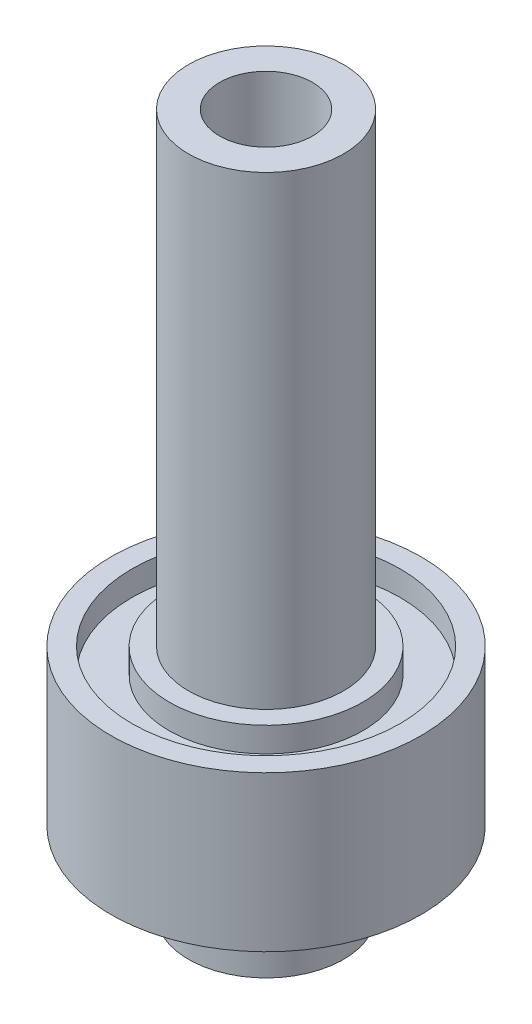
ISO-10303-21;
HEADER;
FILE_DESCRIPTION(('STEP AP214'),'2;1');
FILE_NAME('part.step','',(''),(''),'','','');
FILE_SCHEMA(('AUTOMOTIVE_DESIGN { 1 0 10303 214 1 1 1 1 }'));
ENDSEC;
DATA;
#1=APPLICATION_CONTEXT('core data for automotive mechanical design processes');
#2=APPLICATION_PROTOCOL_DEFINITION('international standard','automotive_design',2000,#1);
#3=PRODUCT_CONTEXT('',#1,'mechanical');
#4=PRODUCT('Part','Part','',(#3));
#5=PRODUCT_RELATED_PRODUCT_CATEGORY('part','',(#4));
#6=PRODUCT_DEFINITION_FORMATION('','',#4);
#7=PRODUCT_DEFINITION_CONTEXT('part definition',#1,'design');
#8=PRODUCT_DEFINITION('design','',#6,#7);
#9=PRODUCT_DEFINITION_SHAPE('','',#8);
#10=(LENGTH_UNIT() NAMED_UNIT(*) SI_UNIT(.MILLI.,.METRE.));
#11=(NAMED_UNIT(*) PLANE_ANGLE_UNIT() SI_UNIT($,.RADIAN.));
#12=(NAMED_UNIT(*) SI_UNIT($,.STERADIAN.) SOLID_ANGLE_UNIT());
#13=UNCERTAINTY_MEASURE_WITH_UNIT(LENGTH_MEASURE(1.E-05),#10,'distance_accuracy_value','');
#14=(GEOMETRIC_REPRESENTATION_CONTEXT(3) GLOBAL_UNCERTAINTY_ASSIGNED_CONTEXT((#13)) GLOBAL_UNIT_ASSIGNED_CONTEXT((#10,
#11,#12)) REPRESENTATION_CONTEXT('',''));
#15=CARTESIAN_POINT('',(0.,0.,0.));
#16=DIRECTION('',(0.,0.,1.));
#17=DIRECTION('',(1.,0.,0.));
#18=AXIS2_PLACEMENT_3D('',#15,#16,#17);
#19=CARTESIAN_POINT('',(0.,0.,0.));
#20=DIRECTION('',(0.,-1.,0.));
#21=DIRECTION('',(0.,0.,-1.));
#22=AXIS2_PLACEMENT_3D('',#19,#20,#21);
#23=CYLINDRICAL_SURFACE('',#22,3.81);
#24=CARTESIAN_POINT('',(0.,57.15,0.));
#25=DIRECTION('',(0.,-1.,0.));
#26=DIRECTION('',(0.,0.,-1.));
#27=AXIS2_PLACEMENT_3D('',#24,#25,#26);
#28=CIRCLE('',#27,3.81000000000001);
#29=CARTESIAN_POINT('',(0.,57.15,-3.81000000000001));
#30=VERTEX_POINT('',#29);
#31=EDGE_CURVE('E88',#30,#30,#28,.T.);
#32=ORIENTED_EDGE('',*,*,#31,.F.);
#33=EDGE_LOOP('',(#32));
#34=FACE_BOUND('',#33,.T.);
#35=CARTESIAN_POINT('',(0.,0.,0.));
#36=DIRECTION('',(0.,-1.,0.));
#37=DIRECTION('',(0.,0.,-1.));
#38=AXIS2_PLACEMENT_3D('',#35,#36,#37);
#39=CIRCLE('',#38,3.81);
#40=CARTESIAN_POINT('',(0.,0.,-3.81));
#41=VERTEX_POINT('',#40);
#42=EDGE_CURVE('E10',#41,#41,#39,.T.);
#43=ORIENTED_EDGE('',*,*,#42,.T.);
#44=EDGE_LOOP('',(#43));
#45=FACE_BOUND('',#44,.T.);
#46=ADVANCED_FACE('F37',(#34,#45),#23,.F.);
#47=CARTESIAN_POINT('',(-3.81,0.,0.));
#48=DIRECTION('',(0.,1.,0.));
#49=DIRECTION('',(0.,0.,1.));
#50=AXIS2_PLACEMENT_3D('',#47,#48,#49);
#51=PLANE('',#50);
#52=ORIENTED_EDGE('',*,*,#42,.F.);
#53=EDGE_LOOP('',(#52));
#54=FACE_BOUND('',#53,.T.);
#55=CARTESIAN_POINT('',(0.,0.,0.));
#56=DIRECTION('',(0.,-1.,0.));
#57=DIRECTION('',(0.,0.,-1.));
#58=AXIS2_PLACEMENT_3D('',#55,#56,#57);
#59=CIRCLE('',#58,6.35);
#60=CARTESIAN_POINT('',(0.,0.,-6.35));
#61=VERTEX_POINT('',#60);
#62=EDGE_CURVE('E44',#61,#61,#59,.T.);
#63=ORIENTED_EDGE('',*,*,#62,.T.);
#64=EDGE_LOOP('',(#63));
#65=FACE_BOUND('',#64,.T.);
#66=ADVANCED_FACE('F96',(#54,#65),#51,.F.);
#67=CARTESIAN_POINT('',(0.,0.,0.));
#68=DIRECTION('',(0.,-1.,0.));
#69=DIRECTION('',(0.,0.,-1.));
#70=AXIS2_PLACEMENT_3D('',#67,#68,#69);
#71=CYLINDRICAL_SURFACE('',#70,6.35);
#72=ORIENTED_EDGE('',*,*,#62,.F.);
#73=EDGE_LOOP('',(#72));
#74=FACE_BOUND('',#73,.T.);
#75=CARTESIAN_POINT('',(0.,6.35,0.));
#76=DIRECTION('',(0.,-1.,0.));
#77=DIRECTION('',(0.,0.,-1.));
#78=AXIS2_PLACEMENT_3D('',#75,#76,#77);
#79=CIRCLE('',#78,6.35);
#80=CARTESIAN_POINT('',(0.,6.35,-6.35));
#81=VERTEX_POINT('',#80);
#82=EDGE_CURVE('E49',#81,#81,#79,.T.);
#83=ORIENTED_EDGE('',*,*,#82,.T.);
#84=EDGE_LOOP('',(#83));
#85=FACE_BOUND('',#84,.T.);
#86=ADVANCED_FACE('F100',(#74,#85),#71,.T.);
#87=CARTESIAN_POINT('',(-6.35,6.35,0.));
#88=DIRECTION('',(0.,1.,0.));
#89=DIRECTION('',(0.,0.,1.));
#90=AXIS2_PLACEMENT_3D('',#87,#88,#89);
#91=PLANE('',#90);
#92=ORIENTED_EDGE('',*,*,#82,.F.);
#93=EDGE_LOOP('',(#92));
#94=FACE_BOUND('',#93,.T.);
#95=CARTESIAN_POINT('',(0.,6.35,0.));
#96=DIRECTION('',(0.,-1.,0.));
#97=DIRECTION('',(0.,0.,-1.));
#98=AXIS2_PLACEMENT_3D('',#95,#96,#97);
#99=CIRCLE('',#98,12.7);
#100=CARTESIAN_POINT('',(0.,6.35,-12.7));
#101=VERTEX_POINT('',#100);
#102=EDGE_CURVE('E54',#101,#101,#99,.T.);
#103=ORIENTED_EDGE('',*,*,#102,.T.);
#104=EDGE_LOOP('',(#103));
#105=FACE_BOUND('',#104,.T.);
#106=ADVANCED_FACE('F105',(#94,#105),#91,.F.);
#107=CARTESIAN_POINT('',(0.,0.,0.));
#108=DIRECTION('',(0.,-1.,0.));
#109=DIRECTION('',(0.,0.,-1.));
#110=AXIS2_PLACEMENT_3D('',#107,#108,#109);
#111=CYLINDRICAL_SURFACE('',#110,12.7);
#112=ORIENTED_EDGE('',*,*,#102,.F.);
#113=EDGE_LOOP('',(#112));
#114=FACE_BOUND('',#113,.T.);
#115=CARTESIAN_POINT('',(0.,19.05,0.));
#116=DIRECTION('',(0.,-1.,0.));
#117=DIRECTION('',(0.,0.,-1.));
#118=AXIS2_PLACEMENT_3D('',#115,#116,#117);
#119=CIRCLE('',#118,12.7);
#120=CARTESIAN_POINT('',(0.,19.05,-12.7));
#121=VERTEX_POINT('',#120);
#122=EDGE_CURVE('E60',#121,#121,#119,.T.);
#123=ORIENTED_EDGE('',*,*,#122,.T.);
#124=EDGE_LOOP('',(#123));
#125=FACE_BOUND('',#124,.T.);
#126=ADVANCED_FACE('F111',(#114,#125),#111,.T.);
#127=CARTESIAN_POINT('',(-12.7,19.05,0.));
#128=DIRECTION('',(0.,-1.,0.));
#129=DIRECTION('',(0.,0.,-1.));
#130=AXIS2_PLACEMENT_3D('',#127,#128,#129);
#131=PLANE('',#130);
#132=ORIENTED_EDGE('',*,*,#122,.F.);
#133=EDGE_LOOP('',(#132));
#134=FACE_BOUND('',#133,.T.);
#135=CARTESIAN_POINT('',(0.,19.05,0.));
#136=DIRECTION('',(0.,-1.,0.));
#137=DIRECTION('',(0.,0.,-1.));
#138=AXIS2_PLACEMENT_3D('',#135,#136,#137);
#139=CIRCLE('',#138,10.9855);
#140=CARTESIAN_POINT('',(0.,19.05,-10.9855));
#141=VERTEX_POINT('',#140);
#142=EDGE_CURVE('E64',#141,#141,#139,.T.);
#143=ORIENTED_EDGE('',*,*,#142,.T.);
#144=EDGE_LOOP('',(#143));
#145=FACE_BOUND('',#144,.T.);
#146=ADVANCED_FACE('F115',(#134,#145),#131,.F.);
#147=CARTESIAN_POINT('',(0.,0.,0.));
#148=DIRECTION('',(0.,-1.,0.));
#149=DIRECTION('',(0.,0.,-1.));
#150=AXIS2_PLACEMENT_3D('',#147,#148,#149);
#151=CYLINDRICAL_SURFACE('',#150,10.9855);
#152=ORIENTED_EDGE('',*,*,#142,.F.);
#153=EDGE_LOOP('',(#152));
#154=FACE_BOUND('',#153,.T.);
#155=CARTESIAN_POINT('',(0.,17.018,0.));
#156=DIRECTION('',(0.,-1.,0.));
#157=DIRECTION('',(0.,0.,-1.));
#158=AXIS2_PLACEMENT_3D('',#155,#156,#157);
#159=CIRCLE('',#158,10.9855);
#160=CARTESIAN_POINT('',(0.,17.018,-10.9855));
#161=VERTEX_POINT('',#160);
#162=EDGE_CURVE('E68',#161,#161,#159,.T.);
#163=ORIENTED_EDGE('',*,*,#162,.T.);
#164=EDGE_LOOP('',(#163));
#165=FACE_BOUND('',#164,.T.);
#166=ADVANCED_FACE('F119',(#154,#165),#151,.F.);
#167=CARTESIAN_POINT('',(-10.9855,17.018,0.));
#168=DIRECTION('',(0.,-1.,0.));
#169=DIRECTION('',(0.,0.,-1.));
#170=AXIS2_PLACEMENT_3D('',#167,#168,#169);
#171=PLANE('',#170);
#172=ORIENTED_EDGE('',*,*,#162,.F.);
#173=EDGE_LOOP('',(#172));
#174=FACE_BOUND('',#173,.T.);
#175=CARTESIAN_POINT('',(0.,17.018,0.));
#176=DIRECTION('',(0.,-1.,0.));
#177=DIRECTION('',(0.,0.,-1.));
#178=AXIS2_PLACEMENT_3D('',#175,#176,#177);
#179=CIRCLE('',#178,7.9375);
#180=CARTESIAN_POINT('',(0.,17.018,-7.9375));
#181=VERTEX_POINT('',#180);
#182=EDGE_CURVE('E72',#181,#181,#179,.T.);
#183=ORIENTED_EDGE('',*,*,#182,.T.);
#184=EDGE_LOOP('',(#183));
#185=FACE_BOUND('',#184,.T.);
#186=ADVANCED_FACE('F123',(#174,#185),#171,.F.);
#187=CARTESIAN_POINT('',(0.,0.,0.));
#188=DIRECTION('',(0.,-1.,0.));
#189=DIRECTION('',(0.,0.,-1.));
#190=AXIS2_PLACEMENT_3D('',#187,#188,#189);
#191=CYLINDRICAL_SURFACE('',#190,7.9375);
#192=ORIENTED_EDGE('',*,*,#182,.F.);
#193=EDGE_LOOP('',(#192));
#194=FACE_BOUND('',#193,.T.);
#195=CARTESIAN_POINT('',(0.,19.05,0.));
#196=DIRECTION('',(0.,-1.,0.));
#197=DIRECTION('',(0.,0.,-1.));
#198=AXIS2_PLACEMENT_3D('',#195,#196,#197);
#199=CIRCLE('',#198,7.9375);
#200=CARTESIAN_POINT('',(0.,19.05,-7.9375));
#201=VERTEX_POINT('',#200);
#202=EDGE_CURVE('E76',#201,#201,#199,.T.);
#203=ORIENTED_EDGE('',*,*,#202,.T.);
#204=EDGE_LOOP('',(#203));
#205=FACE_BOUND('',#204,.T.);
#206=ADVANCED_FACE('F127',(#194,#205),#191,.T.);
#207=CARTESIAN_POINT('',(-7.9375,19.05,0.));
#208=DIRECTION('',(0.,-1.,0.));
#209=DIRECTION('',(0.,0.,-1.));
#210=AXIS2_PLACEMENT_3D('',#207,#208,#209);
#211=PLANE('',#210);
#212=ORIENTED_EDGE('',*,*,#202,.F.);
#213=EDGE_LOOP('',(#212));
#214=FACE_BOUND('',#213,.T.);
#215=CARTESIAN_POINT('',(0.,19.05,0.));
#216=DIRECTION('',(0.,-1.,0.));
#217=DIRECTION('',(0.,0.,-1.));
#218=AXIS2_PLACEMENT_3D('',#215,#216,#217);
#219=CIRCLE('',#218,6.35);
#220=CARTESIAN_POINT('',(0.,19.05,-6.35));
#221=VERTEX_POINT('',#220);
#222=EDGE_CURVE('E80',#221,#221,#219,.T.);
#223=ORIENTED_EDGE('',*,*,#222,.T.);
#224=EDGE_LOOP('',(#223));
#225=FACE_BOUND('',#224,.T.);
#226=ADVANCED_FACE('F131',(#214,#225),#211,.F.);
#227=CARTESIAN_POINT('',(0.,0.,0.));
#228=DIRECTION('',(0.,-1.,0.));
#229=DIRECTION('',(0.,0.,-1.));
#230=AXIS2_PLACEMENT_3D('',#227,#228,#229);
#231=CYLINDRICAL_SURFACE('',#230,6.35);
#232=ORIENTED_EDGE('',*,*,#222,.F.);
#233=EDGE_LOOP('',(#232));
#234=FACE_BOUND('',#233,.T.);
#235=CARTESIAN_POINT('',(0.,57.15,0.));
#236=DIRECTION('',(0.,-1.,0.));
#237=DIRECTION('',(0.,0.,-1.));
#238=AXIS2_PLACEMENT_3D('',#235,#236,#237);
#239=CIRCLE('',#238,6.35);
#240=CARTESIAN_POINT('',(0.,57.15,-6.35));
#241=VERTEX_POINT('',#240);
#242=EDGE_CURVE('E84',#241,#241,#239,.T.);
#243=ORIENTED_EDGE('',*,*,#242,.T.);
#244=EDGE_LOOP('',(#243));
#245=FACE_BOUND('',#244,.T.);
#246=ADVANCED_FACE('F135',(#234,#245),#231,.T.);
#247=CARTESIAN_POINT('',(-6.35,57.15,0.));
#248=DIRECTION('',(0.,-1.,0.));
#249=DIRECTION('',(0.,0.,-1.));
#250=AXIS2_PLACEMENT_3D('',#247,#248,#249);
#251=PLANE('',#250);
#252=ORIENTED_EDGE('',*,*,#242,.F.);
#253=EDGE_LOOP('',(#252));
#254=FACE_BOUND('',#253,.T.);
#255=ORIENTED_EDGE('',*,*,#31,.T.);
#256=EDGE_LOOP('',(#255));
#257=FACE_BOUND('',#256,.T.);
#258=ADVANCED_FACE('F93',(#254,#257),#251,.F.);
#259=CLOSED_SHELL('',(#46,#66,#86,#106,#126,#146,#166,#186,#206,#226,#246,#258));
#260=MANIFOLD_SOLID_BREP('B2',#259);
#261=ADVANCED_BREP_SHAPE_REPRESENTATION('',(#18,#260),#14);
#262=SHAPE_DEFINITION_REPRESENTATION(#9,#261);
ENDSEC;
END-ISO-10303-21;
